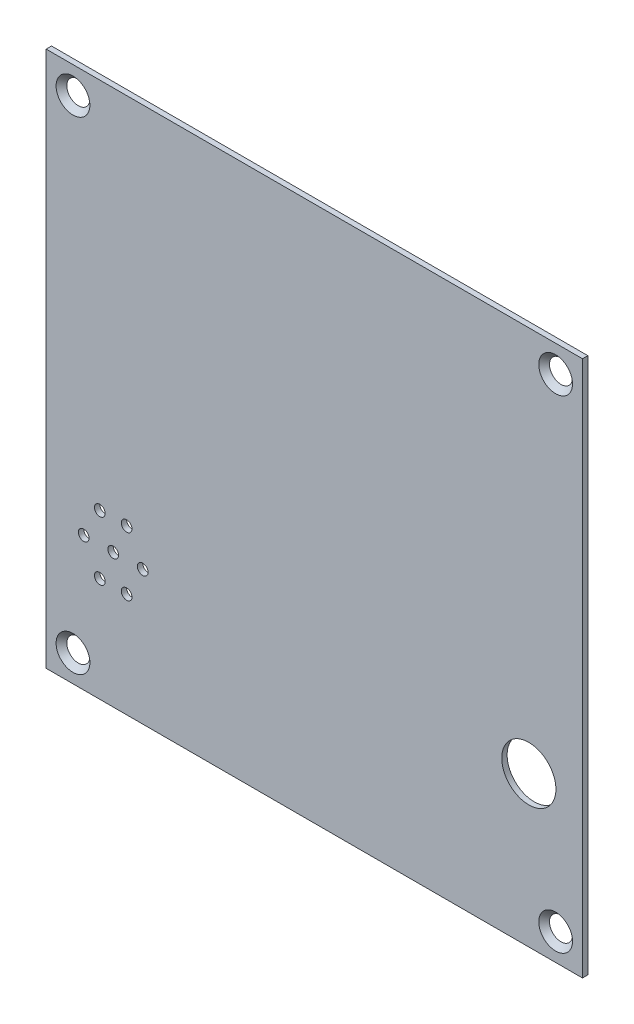
ISO-10303-21;
HEADER;
FILE_DESCRIPTION(('STEP AP214'),'2;1');
FILE_NAME('part.step','',(''),(''),'','','');
FILE_SCHEMA(('AUTOMOTIVE_DESIGN { 1 0 10303 214 1 1 1 1 }'));
ENDSEC;
DATA;
#1=APPLICATION_CONTEXT('core data for automotive mechanical design processes');
#2=APPLICATION_PROTOCOL_DEFINITION('international standard','automotive_design',2000,#1);
#3=PRODUCT_CONTEXT('',#1,'mechanical');
#4=PRODUCT('Part','Part','',(#3));
#5=PRODUCT_RELATED_PRODUCT_CATEGORY('part','',(#4));
#6=PRODUCT_DEFINITION_FORMATION('','',#4);
#7=PRODUCT_DEFINITION_CONTEXT('part definition',#1,'design');
#8=PRODUCT_DEFINITION('design','',#6,#7);
#9=PRODUCT_DEFINITION_SHAPE('','',#8);
#10=(LENGTH_UNIT() NAMED_UNIT(*) SI_UNIT(.MILLI.,.METRE.));
#11=(NAMED_UNIT(*) PLANE_ANGLE_UNIT() SI_UNIT($,.RADIAN.));
#12=(NAMED_UNIT(*) SI_UNIT($,.STERADIAN.) SOLID_ANGLE_UNIT());
#13=UNCERTAINTY_MEASURE_WITH_UNIT(LENGTH_MEASURE(1.E-05),#10,'distance_accuracy_value','');
#14=(GEOMETRIC_REPRESENTATION_CONTEXT(3) GLOBAL_UNCERTAINTY_ASSIGNED_CONTEXT((#13)) GLOBAL_UNIT_ASSIGNED_CONTEXT((#10,
#11,#12)) REPRESENTATION_CONTEXT('',''));
#15=CARTESIAN_POINT('',(0.,0.,0.));
#16=DIRECTION('',(0.,0.,1.));
#17=DIRECTION('',(1.,0.,0.));
#18=AXIS2_PLACEMENT_3D('',#15,#16,#17);
#19=CARTESIAN_POINT('',(0.,0.,0.));
#20=DIRECTION('',(0.,0.,-1.));
#21=DIRECTION('',(-1.,0.,0.));
#22=AXIS2_PLACEMENT_3D('',#19,#20,#21);
#23=PLANE('',#22);
#24=CARTESIAN_POINT('',(90.,28.,0.));
#25=DIRECTION('',(0.,0.,1.));
#26=DIRECTION('',(1.,0.,0.));
#27=AXIS2_PLACEMENT_3D('',#24,#25,#26);
#28=CIRCLE('',#27,5.05);
#29=CARTESIAN_POINT('',(95.05,28.,0.));
#30=VERTEX_POINT('',#29);
#31=EDGE_CURVE('E133',#30,#30,#28,.T.);
#32=ORIENTED_EDGE('',*,*,#31,.T.);
#33=EDGE_LOOP('',(#32));
#34=FACE_BOUND('',#33,.T.);
#35=CARTESIAN_POINT('',(15.,19.5,0.));
#36=DIRECTION('',(0.,0.,1.));
#37=DIRECTION('',(1.,0.,0.));
#38=AXIS2_PLACEMENT_3D('',#35,#36,#37);
#39=CIRCLE('',#38,1.);
#40=CARTESIAN_POINT('',(16.,19.5,0.));
#41=VERTEX_POINT('',#40);
#42=EDGE_CURVE('E163',#41,#41,#39,.T.);
#43=ORIENTED_EDGE('',*,*,#42,.T.);
#44=EDGE_LOOP('',(#43));
#45=FACE_BOUND('',#44,.T.);
#46=CARTESIAN_POINT('',(15.,30.5,0.));
#47=DIRECTION('',(0.,0.,1.));
#48=DIRECTION('',(1.,0.,0.));
#49=AXIS2_PLACEMENT_3D('',#46,#47,#48);
#50=CIRCLE('',#49,1.);
#51=CARTESIAN_POINT('',(16.,30.5,0.));
#52=VERTEX_POINT('',#51);
#53=EDGE_CURVE('E169',#52,#52,#50,.T.);
#54=ORIENTED_EDGE('',*,*,#53,.T.);
#55=EDGE_LOOP('',(#54));
#56=FACE_BOUND('',#55,.T.);
#57=CARTESIAN_POINT('',(9.99999999999999,30.5,0.));
#58=DIRECTION('',(0.,0.,1.));
#59=DIRECTION('',(1.,0.,0.));
#60=AXIS2_PLACEMENT_3D('',#57,#58,#59);
#61=CIRCLE('',#60,1.);
#62=CARTESIAN_POINT('',(11.,30.5,0.));
#63=VERTEX_POINT('',#62);
#64=EDGE_CURVE('E152',#63,#63,#61,.T.);
#65=ORIENTED_EDGE('',*,*,#64,.T.);
#66=EDGE_LOOP('',(#65));
#67=FACE_BOUND('',#66,.T.);
#68=CARTESIAN_POINT('',(12.5,25.,0.));
#69=DIRECTION('',(0.,0.,1.));
#70=DIRECTION('',(1.,0.,0.));
#71=AXIS2_PLACEMENT_3D('',#68,#69,#70);
#72=CIRCLE('',#71,1.);
#73=CARTESIAN_POINT('',(13.5,25.,0.));
#74=VERTEX_POINT('',#73);
#75=EDGE_CURVE('E144',#74,#74,#72,.T.);
#76=ORIENTED_EDGE('',*,*,#75,.T.);
#77=EDGE_LOOP('',(#76));
#78=FACE_BOUND('',#77,.T.);
#79=CARTESIAN_POINT('',(9.99999999999999,19.5,0.));
#80=DIRECTION('',(0.,0.,1.));
#81=DIRECTION('',(1.,0.,0.));
#82=AXIS2_PLACEMENT_3D('',#79,#80,#81);
#83=CIRCLE('',#82,1.);
#84=CARTESIAN_POINT('',(11.,19.5,0.));
#85=VERTEX_POINT('',#84);
#86=EDGE_CURVE('E137',#85,#85,#83,.T.);
#87=ORIENTED_EDGE('',*,*,#86,.T.);
#88=EDGE_LOOP('',(#87));
#89=FACE_BOUND('',#88,.T.);
#90=CARTESIAN_POINT('',(6.99999999999999,25.,0.));
#91=DIRECTION('',(0.,0.,1.));
#92=DIRECTION('',(1.,0.,0.));
#93=AXIS2_PLACEMENT_3D('',#90,#91,#92);
#94=CIRCLE('',#93,1.);
#95=CARTESIAN_POINT('',(7.99999999999999,25.,0.));
#96=VERTEX_POINT('',#95);
#97=EDGE_CURVE('E138',#96,#96,#94,.T.);
#98=ORIENTED_EDGE('',*,*,#97,.T.);
#99=EDGE_LOOP('',(#98));
#100=FACE_BOUND('',#99,.T.);
#101=CARTESIAN_POINT('',(18.,25.,0.));
#102=DIRECTION('',(0.,0.,1.));
#103=DIRECTION('',(1.,0.,0.));
#104=AXIS2_PLACEMENT_3D('',#101,#102,#103);
#105=CIRCLE('',#104,1.);
#106=CARTESIAN_POINT('',(19.,25.,0.));
#107=VERTEX_POINT('',#106);
#108=EDGE_CURVE('E151',#107,#107,#105,.T.);
#109=ORIENTED_EDGE('',*,*,#108,.T.);
#110=EDGE_LOOP('',(#109));
#111=FACE_BOUND('',#110,.T.);
#112=CARTESIAN_POINT('',(4.99999999999999,95.,0.));
#113=DIRECTION('',(0.,0.,-1.));
#114=DIRECTION('',(-1.,0.,0.));
#115=AXIS2_PLACEMENT_3D('',#112,#113,#114);
#116=CIRCLE('',#115,2.15);
#117=CARTESIAN_POINT('',(2.84999999999999,95.,0.));
#118=VERTEX_POINT('',#117);
#119=EDGE_CURVE('E127',#118,#118,#116,.T.);
#120=ORIENTED_EDGE('',*,*,#119,.F.);
#121=EDGE_LOOP('',(#120));
#122=FACE_BOUND('',#121,.T.);
#123=CARTESIAN_POINT('',(95.,5.,0.));
#124=DIRECTION('',(0.,0.,-1.));
#125=DIRECTION('',(-1.,0.,0.));
#126=AXIS2_PLACEMENT_3D('',#123,#124,#125);
#127=CIRCLE('',#126,2.15);
#128=CARTESIAN_POINT('',(92.85,5.,0.));
#129=VERTEX_POINT('',#128);
#130=EDGE_CURVE('E111',#129,#129,#127,.T.);
#131=ORIENTED_EDGE('',*,*,#130,.F.);
#132=EDGE_LOOP('',(#131));
#133=FACE_BOUND('',#132,.T.);
#134=CARTESIAN_POINT('',(5.,5.,0.));
#135=DIRECTION('',(0.,0.,-1.));
#136=DIRECTION('',(-1.,0.,0.));
#137=AXIS2_PLACEMENT_3D('',#134,#135,#136);
#138=CIRCLE('',#137,2.15);
#139=CARTESIAN_POINT('',(2.85,5.,0.));
#140=VERTEX_POINT('',#139);
#141=EDGE_CURVE('E103',#140,#140,#138,.T.);
#142=ORIENTED_EDGE('',*,*,#141,.F.);
#143=EDGE_LOOP('',(#142));
#144=FACE_BOUND('',#143,.T.);
#145=DIRECTION('',(0.,-1.,0.));
#146=VECTOR('',#145,1.);
#147=CARTESIAN_POINT('',(0.,0.,0.));
#148=LINE('',#147,#146);
#149=CARTESIAN_POINT('',(0.,100.,0.));
#150=VERTEX_POINT('',#149);
#151=CARTESIAN_POINT('',(0.,0.,0.));
#152=VERTEX_POINT('',#151);
#153=EDGE_CURVE('E100',#150,#152,#148,.T.);
#154=ORIENTED_EDGE('',*,*,#153,.F.);
#155=DIRECTION('',(-1.,0.,0.));
#156=VECTOR('',#155,1.);
#157=CARTESIAN_POINT('',(0.,100.,0.));
#158=LINE('',#157,#156);
#159=CARTESIAN_POINT('',(100.,100.,0.));
#160=VERTEX_POINT('',#159);
#161=EDGE_CURVE('E75',#160,#150,#158,.T.);
#162=ORIENTED_EDGE('',*,*,#161,.F.);
#163=DIRECTION('',(0.,1.,0.));
#164=VECTOR('',#163,1.);
#165=CARTESIAN_POINT('',(100.,0.,0.));
#166=LINE('',#165,#164);
#167=CARTESIAN_POINT('',(100.,0.,0.));
#168=VERTEX_POINT('',#167);
#169=EDGE_CURVE('E69',#168,#160,#166,.T.);
#170=ORIENTED_EDGE('',*,*,#169,.F.);
#171=DIRECTION('',(1.,0.,0.));
#172=VECTOR('',#171,1.);
#173=CARTESIAN_POINT('',(0.,0.,0.));
#174=LINE('',#173,#172);
#175=EDGE_CURVE('E91',#152,#168,#174,.T.);
#176=ORIENTED_EDGE('',*,*,#175,.F.);
#177=EDGE_LOOP('',(#154,#162,#170,#176));
#178=FACE_BOUND('',#177,.T.);
#179=CARTESIAN_POINT('',(95.,95.,0.));
#180=DIRECTION('',(0.,0.,-1.));
#181=DIRECTION('',(-1.,0.,0.));
#182=AXIS2_PLACEMENT_3D('',#179,#180,#181);
#183=CIRCLE('',#182,2.15);
#184=CARTESIAN_POINT('',(92.85,95.,0.));
#185=VERTEX_POINT('',#184);
#186=EDGE_CURVE('E37',#185,#185,#183,.T.);
#187=ORIENTED_EDGE('',*,*,#186,.F.);
#188=EDGE_LOOP('',(#187));
#189=FACE_BOUND('',#188,.T.);
#190=ADVANCED_FACE('F33',(#34,#45,#56,#67,#78,#89,#100,#111,#122,#133,#144,#178,#189),#23,.T.);
#191=CARTESIAN_POINT('',(0.,0.,1.));
#192=DIRECTION('',(1.,0.,0.));
#193=DIRECTION('',(0.,1.,0.));
#194=AXIS2_PLACEMENT_3D('',#191,#192,#193);
#195=PLANE('',#194);
#196=ORIENTED_EDGE('',*,*,#153,.T.);
#197=DIRECTION('',(0.,0.,-1.));
#198=VECTOR('',#197,1.);
#199=CARTESIAN_POINT('',(0.,0.,1.));
#200=LINE('',#199,#198);
#201=CARTESIAN_POINT('',(0.,0.,1.));
#202=VERTEX_POINT('',#201);
#203=EDGE_CURVE('E11',#202,#152,#200,.T.);
#204=ORIENTED_EDGE('',*,*,#203,.F.);
#205=DIRECTION('',(0.,-1.,0.));
#206=VECTOR('',#205,1.);
#207=CARTESIAN_POINT('',(0.,0.,1.));
#208=LINE('',#207,#206);
#209=CARTESIAN_POINT('',(0.,100.,1.));
#210=VERTEX_POINT('',#209);
#211=EDGE_CURVE('E87',#210,#202,#208,.T.);
#212=ORIENTED_EDGE('',*,*,#211,.F.);
#213=DIRECTION('',(0.,0.,-1.));
#214=VECTOR('',#213,1.);
#215=CARTESIAN_POINT('',(0.,100.,1.));
#216=LINE('',#215,#214);
#217=EDGE_CURVE('E96',#210,#150,#216,.T.);
#218=ORIENTED_EDGE('',*,*,#217,.T.);
#219=EDGE_LOOP('',(#196,#204,#212,#218));
#220=FACE_BOUND('',#219,.T.);
#221=ADVANCED_FACE('F35',(#220),#195,.F.);
#222=CARTESIAN_POINT('',(0.,0.,1.));
#223=DIRECTION('',(0.,1.,0.));
#224=DIRECTION('',(0.,0.,1.));
#225=AXIS2_PLACEMENT_3D('',#222,#223,#224);
#226=PLANE('',#225);
#227=ORIENTED_EDGE('',*,*,#175,.T.);
#228=DIRECTION('',(0.,0.,-1.));
#229=VECTOR('',#228,1.);
#230=CARTESIAN_POINT('',(100.,0.,1.));
#231=LINE('',#230,#229);
#232=CARTESIAN_POINT('',(100.,0.,1.));
#233=VERTEX_POINT('',#232);
#234=EDGE_CURVE('E43',#233,#168,#231,.T.);
#235=ORIENTED_EDGE('',*,*,#234,.F.);
#236=DIRECTION('',(1.,0.,0.));
#237=VECTOR('',#236,1.);
#238=CARTESIAN_POINT('',(0.,0.,1.));
#239=LINE('',#238,#237);
#240=EDGE_CURVE('E82',#202,#233,#239,.T.);
#241=ORIENTED_EDGE('',*,*,#240,.F.);
#242=ORIENTED_EDGE('',*,*,#203,.T.);
#243=EDGE_LOOP('',(#227,#235,#241,#242));
#244=FACE_BOUND('',#243,.T.);
#245=ADVANCED_FACE('F90',(#244),#226,.F.);
#246=CARTESIAN_POINT('',(100.,0.,1.));
#247=DIRECTION('',(-1.,0.,0.));
#248=DIRECTION('',(0.,-1.,0.));
#249=AXIS2_PLACEMENT_3D('',#246,#247,#248);
#250=PLANE('',#249);
#251=ORIENTED_EDGE('',*,*,#169,.T.);
#252=DIRECTION('',(0.,0.,-1.));
#253=VECTOR('',#252,1.);
#254=CARTESIAN_POINT('',(100.,100.,1.));
#255=LINE('',#254,#253);
#256=CARTESIAN_POINT('',(100.,100.,1.));
#257=VERTEX_POINT('',#256);
#258=EDGE_CURVE('E92',#257,#160,#255,.T.);
#259=ORIENTED_EDGE('',*,*,#258,.F.);
#260=DIRECTION('',(0.,1.,0.));
#261=VECTOR('',#260,1.);
#262=CARTESIAN_POINT('',(100.,0.,1.));
#263=LINE('',#262,#261);
#264=EDGE_CURVE('E85',#233,#257,#263,.T.);
#265=ORIENTED_EDGE('',*,*,#264,.F.);
#266=ORIENTED_EDGE('',*,*,#234,.T.);
#267=EDGE_LOOP('',(#251,#259,#265,#266));
#268=FACE_BOUND('',#267,.T.);
#269=ADVANCED_FACE('F94',(#268),#250,.F.);
#270=CARTESIAN_POINT('',(0.,100.,1.));
#271=DIRECTION('',(0.,-1.,0.));
#272=DIRECTION('',(0.,0.,-1.));
#273=AXIS2_PLACEMENT_3D('',#270,#271,#272);
#274=PLANE('',#273);
#275=ORIENTED_EDGE('',*,*,#161,.T.);
#276=ORIENTED_EDGE('',*,*,#217,.F.);
#277=DIRECTION('',(-1.,0.,0.));
#278=VECTOR('',#277,1.);
#279=CARTESIAN_POINT('',(0.,100.,1.));
#280=LINE('',#279,#278);
#281=EDGE_CURVE('E52',#257,#210,#280,.T.);
#282=ORIENTED_EDGE('',*,*,#281,.F.);
#283=ORIENTED_EDGE('',*,*,#258,.T.);
#284=EDGE_LOOP('',(#275,#276,#282,#283));
#285=FACE_BOUND('',#284,.T.);
#286=ADVANCED_FACE('F194',(#285),#274,.F.);
#287=CARTESIAN_POINT('',(0.,0.,1.));
#288=DIRECTION('',(0.,0.,-1.));
#289=DIRECTION('',(-1.,0.,0.));
#290=AXIS2_PLACEMENT_3D('',#287,#288,#289);
#291=PLANE('',#290);
#292=CARTESIAN_POINT('',(90.,28.,1.));
#293=DIRECTION('',(0.,0.,1.));
#294=DIRECTION('',(1.,0.,0.));
#295=AXIS2_PLACEMENT_3D('',#292,#293,#294);
#296=CIRCLE('',#295,5.05);
#297=CARTESIAN_POINT('',(95.05,28.,1.));
#298=VERTEX_POINT('',#297);
#299=EDGE_CURVE('E147',#298,#298,#296,.T.);
#300=ORIENTED_EDGE('',*,*,#299,.F.);
#301=EDGE_LOOP('',(#300));
#302=FACE_BOUND('',#301,.T.);
#303=CARTESIAN_POINT('',(15.,19.5,1.));
#304=DIRECTION('',(0.,0.,1.));
#305=DIRECTION('',(1.,0.,0.));
#306=AXIS2_PLACEMENT_3D('',#303,#304,#305);
#307=CIRCLE('',#306,1.);
#308=CARTESIAN_POINT('',(16.,19.5,1.));
#309=VERTEX_POINT('',#308);
#310=EDGE_CURVE('E160',#309,#309,#307,.T.);
#311=ORIENTED_EDGE('',*,*,#310,.F.);
#312=EDGE_LOOP('',(#311));
#313=FACE_BOUND('',#312,.T.);
#314=CARTESIAN_POINT('',(15.,30.5,1.));
#315=DIRECTION('',(0.,0.,1.));
#316=DIRECTION('',(1.,0.,0.));
#317=AXIS2_PLACEMENT_3D('',#314,#315,#316);
#318=CIRCLE('',#317,1.);
#319=CARTESIAN_POINT('',(16.,30.5,1.));
#320=VERTEX_POINT('',#319);
#321=EDGE_CURVE('E166',#320,#320,#318,.T.);
#322=ORIENTED_EDGE('',*,*,#321,.F.);
#323=EDGE_LOOP('',(#322));
#324=FACE_BOUND('',#323,.T.);
#325=CARTESIAN_POINT('',(9.99999999999999,30.5,1.));
#326=DIRECTION('',(0.,0.,1.));
#327=DIRECTION('',(1.,0.,0.));
#328=AXIS2_PLACEMENT_3D('',#325,#326,#327);
#329=CIRCLE('',#328,1.);
#330=CARTESIAN_POINT('',(11.,30.5,1.));
#331=VERTEX_POINT('',#330);
#332=EDGE_CURVE('E172',#331,#331,#329,.T.);
#333=ORIENTED_EDGE('',*,*,#332,.F.);
#334=EDGE_LOOP('',(#333));
#335=FACE_BOUND('',#334,.T.);
#336=CARTESIAN_POINT('',(12.5,25.,1.));
#337=DIRECTION('',(0.,0.,1.));
#338=DIRECTION('',(1.,0.,0.));
#339=AXIS2_PLACEMENT_3D('',#336,#337,#338);
#340=CIRCLE('',#339,1.);
#341=CARTESIAN_POINT('',(13.5,25.,1.));
#342=VERTEX_POINT('',#341);
#343=EDGE_CURVE('E141',#342,#342,#340,.T.);
#344=ORIENTED_EDGE('',*,*,#343,.F.);
#345=EDGE_LOOP('',(#344));
#346=FACE_BOUND('',#345,.T.);
#347=CARTESIAN_POINT('',(9.99999999999999,19.5,1.));
#348=DIRECTION('',(0.,0.,1.));
#349=DIRECTION('',(1.,0.,0.));
#350=AXIS2_PLACEMENT_3D('',#347,#348,#349);
#351=CIRCLE('',#350,1.);
#352=CARTESIAN_POINT('',(11.,19.5,1.));
#353=VERTEX_POINT('',#352);
#354=EDGE_CURVE('E134',#353,#353,#351,.T.);
#355=ORIENTED_EDGE('',*,*,#354,.F.);
#356=EDGE_LOOP('',(#355));
#357=FACE_BOUND('',#356,.T.);
#358=CARTESIAN_POINT('',(6.99999999999999,25.,1.));
#359=DIRECTION('',(0.,0.,1.));
#360=DIRECTION('',(1.,0.,0.));
#361=AXIS2_PLACEMENT_3D('',#358,#359,#360);
#362=CIRCLE('',#361,1.);
#363=CARTESIAN_POINT('',(7.99999999999999,25.,1.));
#364=VERTEX_POINT('',#363);
#365=EDGE_CURVE('E155',#364,#364,#362,.T.);
#366=ORIENTED_EDGE('',*,*,#365,.F.);
#367=EDGE_LOOP('',(#366));
#368=FACE_BOUND('',#367,.T.);
#369=CARTESIAN_POINT('',(18.,25.,1.));
#370=DIRECTION('',(0.,0.,1.));
#371=DIRECTION('',(1.,0.,0.));
#372=AXIS2_PLACEMENT_3D('',#369,#370,#371);
#373=CIRCLE('',#372,1.);
#374=CARTESIAN_POINT('',(19.,25.,1.));
#375=VERTEX_POINT('',#374);
#376=EDGE_CURVE('E148',#375,#375,#373,.T.);
#377=ORIENTED_EDGE('',*,*,#376,.F.);
#378=EDGE_LOOP('',(#377));
#379=FACE_BOUND('',#378,.T.);
#380=CARTESIAN_POINT('',(4.99999999999999,95.,1.));
#381=DIRECTION('',(0.,0.,1.));
#382=DIRECTION('',(1.,0.,0.));
#383=AXIS2_PLACEMENT_3D('',#380,#381,#382);
#384=CIRCLE('',#383,3.15);
#385=CARTESIAN_POINT('',(8.14999999999999,95.,1.));
#386=VERTEX_POINT('',#385);
#387=EDGE_CURVE('E130',#386,#386,#384,.T.);
#388=ORIENTED_EDGE('',*,*,#387,.F.);
#389=EDGE_LOOP('',(#388));
#390=FACE_BOUND('',#389,.T.);
#391=CARTESIAN_POINT('',(95.,95.,1.));
#392=DIRECTION('',(0.,0.,1.));
#393=DIRECTION('',(1.,0.,0.));
#394=AXIS2_PLACEMENT_3D('',#391,#392,#393);
#395=CIRCLE('',#394,3.15);
#396=CARTESIAN_POINT('',(98.15,95.,1.));
#397=VERTEX_POINT('',#396);
#398=EDGE_CURVE('E123',#397,#397,#395,.T.);
#399=ORIENTED_EDGE('',*,*,#398,.F.);
#400=EDGE_LOOP('',(#399));
#401=FACE_BOUND('',#400,.T.);
#402=CARTESIAN_POINT('',(95.,5.,1.));
#403=DIRECTION('',(0.,0.,1.));
#404=DIRECTION('',(1.,0.,0.));
#405=AXIS2_PLACEMENT_3D('',#402,#403,#404);
#406=CIRCLE('',#405,3.15);
#407=CARTESIAN_POINT('',(98.15,5.,1.));
#408=VERTEX_POINT('',#407);
#409=EDGE_CURVE('E113',#408,#408,#406,.T.);
#410=ORIENTED_EDGE('',*,*,#409,.F.);
#411=EDGE_LOOP('',(#410));
#412=FACE_BOUND('',#411,.T.);
#413=CARTESIAN_POINT('',(5.,5.,1.));
#414=DIRECTION('',(0.,0.,1.));
#415=DIRECTION('',(1.,0.,0.));
#416=AXIS2_PLACEMENT_3D('',#413,#414,#415);
#417=CIRCLE('',#416,3.15);
#418=CARTESIAN_POINT('',(8.15,5.,1.));
#419=VERTEX_POINT('',#418);
#420=EDGE_CURVE('E110',#419,#419,#417,.T.);
#421=ORIENTED_EDGE('',*,*,#420,.F.);
#422=EDGE_LOOP('',(#421));
#423=FACE_BOUND('',#422,.T.);
#424=ORIENTED_EDGE('',*,*,#211,.T.);
#425=ORIENTED_EDGE('',*,*,#240,.T.);
#426=ORIENTED_EDGE('',*,*,#264,.T.);
#427=ORIENTED_EDGE('',*,*,#281,.T.);
#428=EDGE_LOOP('',(#424,#425,#426,#427));
#429=FACE_BOUND('',#428,.T.);
#430=ADVANCED_FACE('F83',(#302,#313,#324,#335,#346,#357,#368,#379,#390,#401,#412,#423,#429),
#291,.F.);
#431=CARTESIAN_POINT('',(5.,5.,1.));
#432=DIRECTION('',(0.,0.,1.));
#433=DIRECTION('',(1.,0.,0.));
#434=AXIS2_PLACEMENT_3D('',#431,#432,#433);
#435=CONICAL_SURFACE('',#434,3.15,0.785398163397448);
#436=ORIENTED_EDGE('',*,*,#141,.T.);
#437=EDGE_LOOP('',(#436));
#438=FACE_BOUND('',#437,.T.);
#439=ORIENTED_EDGE('',*,*,#420,.T.);
#440=EDGE_LOOP('',(#439));
#441=FACE_BOUND('',#440,.T.);
#442=ADVANCED_FACE('F193',(#438,#441),#435,.F.);
#443=CARTESIAN_POINT('',(95.,5.,1.));
#444=DIRECTION('',(0.,0.,1.));
#445=DIRECTION('',(1.,0.,0.));
#446=AXIS2_PLACEMENT_3D('',#443,#444,#445);
#447=CONICAL_SURFACE('',#446,3.15,0.78539816339745);
#448=ORIENTED_EDGE('',*,*,#130,.T.);
#449=EDGE_LOOP('',(#448));
#450=FACE_BOUND('',#449,.T.);
#451=ORIENTED_EDGE('',*,*,#409,.T.);
#452=EDGE_LOOP('',(#451));
#453=FACE_BOUND('',#452,.T.);
#454=ADVANCED_FACE('F218',(#450,#453),#447,.F.);
#455=CARTESIAN_POINT('',(95.,95.,1.));
#456=DIRECTION('',(0.,0.,1.));
#457=DIRECTION('',(1.,0.,0.));
#458=AXIS2_PLACEMENT_3D('',#455,#456,#457);
#459=CONICAL_SURFACE('',#458,3.15,0.78539816339745);
#460=ORIENTED_EDGE('',*,*,#186,.T.);
#461=EDGE_LOOP('',(#460));
#462=FACE_BOUND('',#461,.T.);
#463=ORIENTED_EDGE('',*,*,#398,.T.);
#464=EDGE_LOOP('',(#463));
#465=FACE_BOUND('',#464,.T.);
#466=ADVANCED_FACE('F224',(#462,#465),#459,.F.);
#467=CARTESIAN_POINT('',(4.99999999999999,95.,1.));
#468=DIRECTION('',(0.,0.,1.));
#469=DIRECTION('',(1.,0.,0.));
#470=AXIS2_PLACEMENT_3D('',#467,#468,#469);
#471=CONICAL_SURFACE('',#470,3.15,0.785398163397448);
#472=ORIENTED_EDGE('',*,*,#119,.T.);
#473=EDGE_LOOP('',(#472));
#474=FACE_BOUND('',#473,.T.);
#475=ORIENTED_EDGE('',*,*,#387,.T.);
#476=EDGE_LOOP('',(#475));
#477=FACE_BOUND('',#476,.T.);
#478=ADVANCED_FACE('F267',(#474,#477),#471,.F.);
#479=CARTESIAN_POINT('',(18.,25.,0.));
#480=DIRECTION('',(0.,0.,1.));
#481=DIRECTION('',(1.,0.,0.));
#482=AXIS2_PLACEMENT_3D('',#479,#480,#481);
#483=CYLINDRICAL_SURFACE('',#482,1.);
#484=ORIENTED_EDGE('',*,*,#108,.F.);
#485=EDGE_LOOP('',(#484));
#486=FACE_BOUND('',#485,.T.);
#487=ORIENTED_EDGE('',*,*,#376,.T.);
#488=EDGE_LOOP('',(#487));
#489=FACE_BOUND('',#488,.T.);
#490=ADVANCED_FACE('F261',(#486,#489),#483,.F.);
#491=CARTESIAN_POINT('',(6.99999999999999,25.,0.));
#492=DIRECTION('',(0.,0.,1.));
#493=DIRECTION('',(1.,0.,0.));
#494=AXIS2_PLACEMENT_3D('',#491,#492,#493);
#495=CYLINDRICAL_SURFACE('',#494,1.);
#496=ORIENTED_EDGE('',*,*,#97,.F.);
#497=EDGE_LOOP('',(#496));
#498=FACE_BOUND('',#497,.T.);
#499=ORIENTED_EDGE('',*,*,#365,.T.);
#500=EDGE_LOOP('',(#499));
#501=FACE_BOUND('',#500,.T.);
#502=ADVANCED_FACE('F266',(#498,#501),#495,.F.);
#503=CARTESIAN_POINT('',(9.99999999999999,19.5,0.));
#504=DIRECTION('',(0.,0.,1.));
#505=DIRECTION('',(1.,0.,0.));
#506=AXIS2_PLACEMENT_3D('',#503,#504,#505);
#507=CYLINDRICAL_SURFACE('',#506,1.);
#508=ORIENTED_EDGE('',*,*,#86,.F.);
#509=EDGE_LOOP('',(#508));
#510=FACE_BOUND('',#509,.T.);
#511=ORIENTED_EDGE('',*,*,#354,.T.);
#512=EDGE_LOOP('',(#511));
#513=FACE_BOUND('',#512,.T.);
#514=ADVANCED_FACE('F279',(#510,#513),#507,.F.);
#515=CARTESIAN_POINT('',(12.5,25.,0.));
#516=DIRECTION('',(0.,0.,1.));
#517=DIRECTION('',(1.,0.,0.));
#518=AXIS2_PLACEMENT_3D('',#515,#516,#517);
#519=CYLINDRICAL_SURFACE('',#518,1.);
#520=ORIENTED_EDGE('',*,*,#75,.F.);
#521=EDGE_LOOP('',(#520));
#522=FACE_BOUND('',#521,.T.);
#523=ORIENTED_EDGE('',*,*,#343,.T.);
#524=EDGE_LOOP('',(#523));
#525=FACE_BOUND('',#524,.T.);
#526=ADVANCED_FACE('F289',(#522,#525),#519,.F.);
#527=CARTESIAN_POINT('',(9.99999999999999,30.5,0.));
#528=DIRECTION('',(0.,0.,1.));
#529=DIRECTION('',(1.,0.,0.));
#530=AXIS2_PLACEMENT_3D('',#527,#528,#529);
#531=CYLINDRICAL_SURFACE('',#530,1.);
#532=ORIENTED_EDGE('',*,*,#64,.F.);
#533=EDGE_LOOP('',(#532));
#534=FACE_BOUND('',#533,.T.);
#535=ORIENTED_EDGE('',*,*,#332,.T.);
#536=EDGE_LOOP('',(#535));
#537=FACE_BOUND('',#536,.T.);
#538=ADVANCED_FACE('F299',(#534,#537),#531,.F.);
#539=CARTESIAN_POINT('',(15.,30.5,0.));
#540=DIRECTION('',(0.,0.,1.));
#541=DIRECTION('',(1.,0.,0.));
#542=AXIS2_PLACEMENT_3D('',#539,#540,#541);
#543=CYLINDRICAL_SURFACE('',#542,1.);
#544=ORIENTED_EDGE('',*,*,#53,.F.);
#545=EDGE_LOOP('',(#544));
#546=FACE_BOUND('',#545,.T.);
#547=ORIENTED_EDGE('',*,*,#321,.T.);
#548=EDGE_LOOP('',(#547));
#549=FACE_BOUND('',#548,.T.);
#550=ADVANCED_FACE('F309',(#546,#549),#543,.F.);
#551=CARTESIAN_POINT('',(15.,19.5,0.));
#552=DIRECTION('',(0.,0.,1.));
#553=DIRECTION('',(1.,0.,0.));
#554=AXIS2_PLACEMENT_3D('',#551,#552,#553);
#555=CYLINDRICAL_SURFACE('',#554,1.);
#556=ORIENTED_EDGE('',*,*,#42,.F.);
#557=EDGE_LOOP('',(#556));
#558=FACE_BOUND('',#557,.T.);
#559=ORIENTED_EDGE('',*,*,#310,.T.);
#560=EDGE_LOOP('',(#559));
#561=FACE_BOUND('',#560,.T.);
#562=ADVANCED_FACE('F187',(#558,#561),#555,.F.);
#563=CARTESIAN_POINT('',(90.,28.,0.));
#564=DIRECTION('',(0.,0.,1.));
#565=DIRECTION('',(1.,0.,0.));
#566=AXIS2_PLACEMENT_3D('',#563,#564,#565);
#567=CYLINDRICAL_SURFACE('',#566,5.05);
#568=ORIENTED_EDGE('',*,*,#31,.F.);
#569=EDGE_LOOP('',(#568));
#570=FACE_BOUND('',#569,.T.);
#571=ORIENTED_EDGE('',*,*,#299,.T.);
#572=EDGE_LOOP('',(#571));
#573=FACE_BOUND('',#572,.T.);
#574=ADVANCED_FACE('F184',(#570,#573),#567,.F.);
#575=CLOSED_SHELL('',(#190,#221,#245,#269,#286,#430,#442,#454,#466,#478,#490,#502,#514,#526,
#538,#550,#562,#574));
#576=MANIFOLD_SOLID_BREP('B2',#575);
#577=ADVANCED_BREP_SHAPE_REPRESENTATION('',(#18,#576),#14);
#578=SHAPE_DEFINITION_REPRESENTATION(#9,#577);
ENDSEC;
END-ISO-10303-21;
